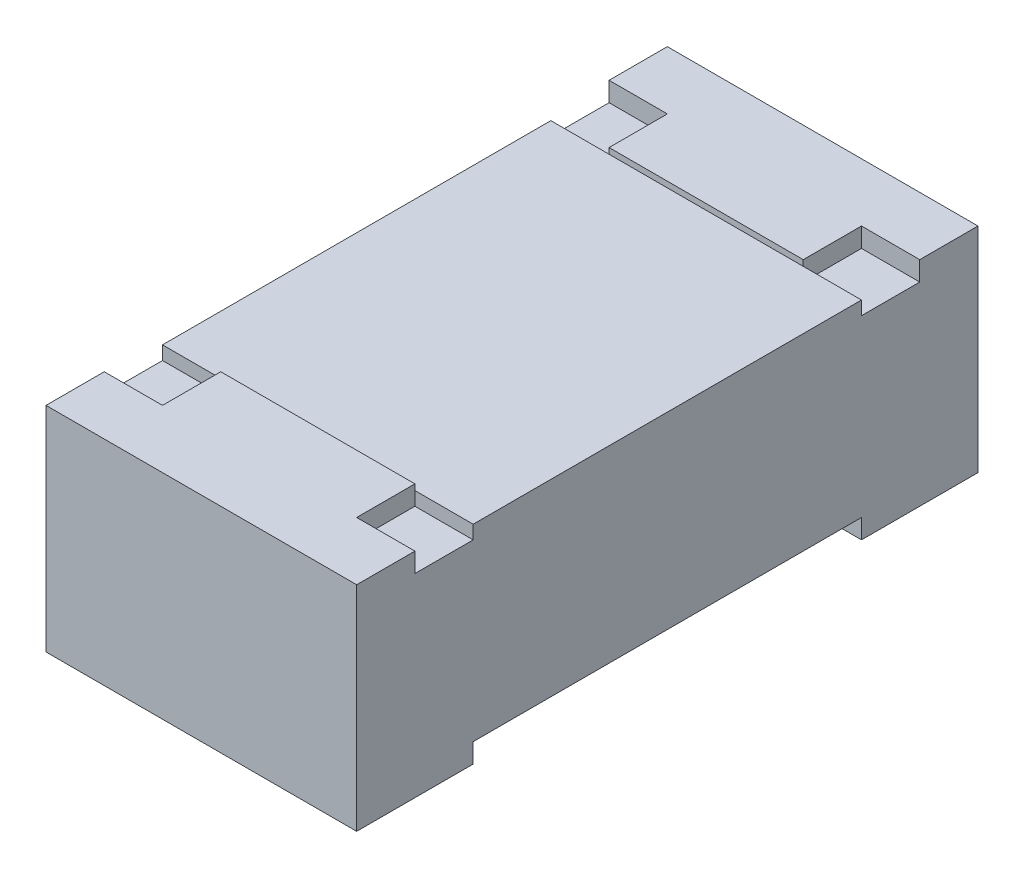
ISO-10303-21;
HEADER;
FILE_DESCRIPTION(('STEP AP214'),'2;1');
FILE_NAME('part.step','',(''),(''),'','','');
FILE_SCHEMA(('AUTOMOTIVE_DESIGN { 1 0 10303 214 1 1 1 1 }'));
ENDSEC;
DATA;
#1=APPLICATION_CONTEXT('core data for automotive mechanical design processes');
#2=APPLICATION_PROTOCOL_DEFINITION('international standard','automotive_design',2000,#1);
#3=PRODUCT_CONTEXT('',#1,'mechanical');
#4=PRODUCT('Part','Part','',(#3));
#5=PRODUCT_RELATED_PRODUCT_CATEGORY('part','',(#4));
#6=PRODUCT_DEFINITION_FORMATION('','',#4);
#7=PRODUCT_DEFINITION_CONTEXT('part definition',#1,'design');
#8=PRODUCT_DEFINITION('design','',#6,#7);
#9=PRODUCT_DEFINITION_SHAPE('','',#8);
#10=(LENGTH_UNIT() NAMED_UNIT(*) SI_UNIT(.MILLI.,.METRE.));
#11=(NAMED_UNIT(*) PLANE_ANGLE_UNIT() SI_UNIT($,.RADIAN.));
#12=(NAMED_UNIT(*) SI_UNIT($,.STERADIAN.) SOLID_ANGLE_UNIT());
#13=UNCERTAINTY_MEASURE_WITH_UNIT(LENGTH_MEASURE(1.E-05),#10,'distance_accuracy_value','');
#14=(GEOMETRIC_REPRESENTATION_CONTEXT(3) GLOBAL_UNCERTAINTY_ASSIGNED_CONTEXT((#13)) GLOBAL_UNIT_ASSIGNED_CONTEXT((#10,
#11,#12)) REPRESENTATION_CONTEXT('',''));
#15=CARTESIAN_POINT('',(0.,0.,0.));
#16=DIRECTION('',(0.,0.,1.));
#17=DIRECTION('',(1.,0.,0.));
#18=AXIS2_PLACEMENT_3D('',#15,#16,#17);
#19=CARTESIAN_POINT('',(-8.4899990165151,1.58166,-11.2730007134848));
#20=DIRECTION('',(0.,-1.,0.));
#21=DIRECTION('',(0.,0.,-1.));
#22=AXIS2_PLACEMENT_3D('',#19,#20,#21);
#23=PLANE('',#22);
#24=DIRECTION('',(-1.,0.,0.));
#25=VECTOR('',#24,1.);
#26=CARTESIAN_POINT('',(-8.4899990165151,1.58166,-11.5730007134848));
#27=LINE('',#26,#25);
#28=CARTESIAN_POINT('',(-8.4899990165151,1.58166,-11.5730007134848));
#29=VERTEX_POINT('',#28);
#30=CARTESIAN_POINT('',(-9.2899990165151,1.58166,-11.5730007134848));
#31=VERTEX_POINT('',#30);
#32=EDGE_CURVE('E19',#29,#31,#27,.T.);
#33=ORIENTED_EDGE('',*,*,#32,.F.);
#34=DIRECTION('',(0.,0.,-1.));
#35=VECTOR('',#34,1.);
#36=CARTESIAN_POINT('',(-8.4899990165151,1.58166,-11.5730007134848));
#37=LINE('',#36,#35);
#38=CARTESIAN_POINT('',(-8.4899990165151,1.58166,-11.2730007134848));
#39=VERTEX_POINT('',#38);
#40=EDGE_CURVE('E295',#39,#29,#37,.T.);
#41=ORIENTED_EDGE('',*,*,#40,.F.);
#42=DIRECTION('',(1.,0.,0.));
#43=VECTOR('',#42,1.);
#44=CARTESIAN_POINT('',(-8.4899990165151,1.58166,-11.2730007134848));
#45=LINE('',#44,#43);
#46=CARTESIAN_POINT('',(-9.2899990165151,1.58166,-11.2730007134848));
#47=VERTEX_POINT('',#46);
#48=EDGE_CURVE('E305',#47,#39,#45,.T.);
#49=ORIENTED_EDGE('',*,*,#48,.F.);
#50=DIRECTION('',(0.,0.,-1.));
#51=VECTOR('',#50,1.);
#52=CARTESIAN_POINT('',(-9.2899990165151,1.58166,-11.5730007134848));
#53=LINE('',#52,#51);
#54=EDGE_CURVE('E231',#47,#31,#53,.T.);
#55=ORIENTED_EDGE('',*,*,#54,.T.);
#56=EDGE_LOOP('',(#33,#41,#49,#55));
#57=FACE_BOUND('',#56,.T.);
#58=ADVANCED_FACE('F16',(#57),#23,.T.);
#59=CARTESIAN_POINT('',(-8.4899990165151,1.58166,-11.5730007134848));
#60=DIRECTION('',(0.,0.,-1.));
#61=DIRECTION('',(-1.,0.,0.));
#62=AXIS2_PLACEMENT_3D('',#59,#60,#61);
#63=PLANE('',#62);
#64=DIRECTION('',(1.,0.,0.));
#65=VECTOR('',#64,1.);
#66=CARTESIAN_POINT('',(-8.4899990165151,1.63166,-11.5730007134848));
#67=LINE('',#66,#65);
#68=CARTESIAN_POINT('',(-8.4899990165151,1.63166,-11.5730007134848));
#69=VERTEX_POINT('',#68);
#70=CARTESIAN_POINT('',(-9.2899990165151,1.63166,-11.5730007134848));
#71=VERTEX_POINT('',#70);
#72=EDGE_CURVE('E247',#69,#71,#67,.F.);
#73=ORIENTED_EDGE('',*,*,#72,.F.);
#74=DIRECTION('',(0.,1.,0.));
#75=VECTOR('',#74,1.);
#76=CARTESIAN_POINT('',(-8.4899990165151,1.58166,-11.5730007134848));
#77=LINE('',#76,#75);
#78=EDGE_CURVE('E226',#29,#69,#77,.T.);
#79=ORIENTED_EDGE('',*,*,#78,.F.);
#80=ORIENTED_EDGE('',*,*,#32,.T.);
#81=DIRECTION('',(0.,1.,0.));
#82=VECTOR('',#81,1.);
#83=CARTESIAN_POINT('',(-9.2899990165151,1.58166,-11.5730007134848));
#84=LINE('',#83,#82);
#85=EDGE_CURVE('E223',#31,#71,#84,.T.);
#86=ORIENTED_EDGE('',*,*,#85,.T.);
#87=EDGE_LOOP('',(#73,#79,#80,#86));
#88=FACE_BOUND('',#87,.T.);
#89=ADVANCED_FACE('F222',(#88),#63,.T.);
#90=CARTESIAN_POINT('',(-8.4899990165151,1.58166,-12.8730007134848));
#91=DIRECTION('',(0.,-1.,0.));
#92=DIRECTION('',(0.,0.,-1.));
#93=AXIS2_PLACEMENT_3D('',#90,#91,#92);
#94=PLANE('',#93);
#95=DIRECTION('',(-1.,0.,0.));
#96=VECTOR('',#95,1.);
#97=CARTESIAN_POINT('',(-8.4899990165151,1.58166,-12.8730007134848));
#98=LINE('',#97,#96);
#99=CARTESIAN_POINT('',(-8.4899990165151,1.58166,-12.8730007134848));
#100=VERTEX_POINT('',#99);
#101=CARTESIAN_POINT('',(-9.2899990165151,1.58166,-12.8730007134848));
#102=VERTEX_POINT('',#101);
#103=EDGE_CURVE('E192',#100,#102,#98,.T.);
#104=ORIENTED_EDGE('',*,*,#103,.F.);
#105=DIRECTION('',(0.,0.,1.));
#106=VECTOR('',#105,1.);
#107=CARTESIAN_POINT('',(-8.4899990165151,1.58166,-12.5730007134848));
#108=LINE('',#107,#106);
#109=CARTESIAN_POINT('',(-8.4899990165151,1.58166,-12.5730007134848));
#110=VERTEX_POINT('',#109);
#111=EDGE_CURVE('E291',#100,#110,#108,.T.);
#112=ORIENTED_EDGE('',*,*,#111,.T.);
#113=DIRECTION('',(1.,0.,0.));
#114=VECTOR('',#113,1.);
#115=CARTESIAN_POINT('',(-8.4899990165151,1.58166,-12.5730007134848));
#116=LINE('',#115,#114);
#117=CARTESIAN_POINT('',(-9.2899990165151,1.58166,-12.5730007134848));
#118=VERTEX_POINT('',#117);
#119=EDGE_CURVE('E187',#118,#110,#116,.T.);
#120=ORIENTED_EDGE('',*,*,#119,.F.);
#121=DIRECTION('',(0.,0.,1.));
#122=VECTOR('',#121,1.);
#123=CARTESIAN_POINT('',(-9.2899990165151,1.58166,-12.5730007134848));
#124=LINE('',#123,#122);
#125=EDGE_CURVE('E203',#102,#118,#124,.T.);
#126=ORIENTED_EDGE('',*,*,#125,.F.);
#127=EDGE_LOOP('',(#104,#112,#120,#126));
#128=FACE_BOUND('',#127,.T.);
#129=ADVANCED_FACE('F204',(#128),#94,.T.);
#130=CARTESIAN_POINT('',(-8.4899990165151,1.58166,-12.5730007134848));
#131=DIRECTION('',(0.,0.,1.));
#132=DIRECTION('',(1.,0.,0.));
#133=AXIS2_PLACEMENT_3D('',#130,#131,#132);
#134=PLANE('',#133);
#135=ORIENTED_EDGE('',*,*,#119,.T.);
#136=DIRECTION('',(0.,1.,0.));
#137=VECTOR('',#136,1.);
#138=CARTESIAN_POINT('',(-8.4899990165151,2.08166,-12.5730007134848));
#139=LINE('',#138,#137);
#140=CARTESIAN_POINT('',(-8.4899990165151,1.63166,-12.5730007134848));
#141=VERTEX_POINT('',#140);
#142=EDGE_CURVE('E289',#110,#141,#139,.T.);
#143=ORIENTED_EDGE('',*,*,#142,.T.);
#144=DIRECTION('',(1.,0.,0.));
#145=VECTOR('',#144,1.);
#146=CARTESIAN_POINT('',(-8.4899990165151,1.63166,-12.5730007134848));
#147=LINE('',#146,#145);
#148=CARTESIAN_POINT('',(-9.2899990165151,1.63166,-12.5730007134848));
#149=VERTEX_POINT('',#148);
#150=EDGE_CURVE('E245',#149,#141,#147,.T.);
#151=ORIENTED_EDGE('',*,*,#150,.F.);
#152=DIRECTION('',(0.,1.,0.));
#153=VECTOR('',#152,1.);
#154=CARTESIAN_POINT('',(-9.2899990165151,2.08166,-12.5730007134848));
#155=LINE('',#154,#153);
#156=EDGE_CURVE('E207',#118,#149,#155,.T.);
#157=ORIENTED_EDGE('',*,*,#156,.F.);
#158=EDGE_LOOP('',(#135,#143,#151,#157));
#159=FACE_BOUND('',#158,.T.);
#160=ADVANCED_FACE('F489',(#159),#134,.T.);
#161=CARTESIAN_POINT('',(-8.4899990165151,2.08166,-12.7230007134848));
#162=DIRECTION('',(0.,0.,-1.));
#163=DIRECTION('',(-1.,0.,0.));
#164=AXIS2_PLACEMENT_3D('',#161,#162,#163);
#165=PLANE('',#164);
#166=DIRECTION('',(0.,1.,0.));
#167=VECTOR('',#166,1.);
#168=CARTESIAN_POINT('',(-8.6399990165151,2.08166,-12.7230007134848));
#169=LINE('',#168,#167);
#170=CARTESIAN_POINT('',(-8.6399990165151,2.13166,-12.7230007134848));
#171=VERTEX_POINT('',#170);
#172=CARTESIAN_POINT('',(-8.6399990165151,2.08166,-12.7230007134848));
#173=VERTEX_POINT('',#172);
#174=EDGE_CURVE('E282',#171,#173,#169,.F.);
#175=ORIENTED_EDGE('',*,*,#174,.T.);
#176=DIRECTION('',(1.,0.,0.));
#177=VECTOR('',#176,1.);
#178=CARTESIAN_POINT('',(-8.4899990165151,2.08166,-12.7230007134848));
#179=LINE('',#178,#177);
#180=CARTESIAN_POINT('',(-8.4899990165151,2.08166,-12.7230007134848));
#181=VERTEX_POINT('',#180);
#182=EDGE_CURVE('E284',#181,#173,#179,.F.);
#183=ORIENTED_EDGE('',*,*,#182,.F.);
#184=DIRECTION('',(0.,1.,0.));
#185=VECTOR('',#184,1.);
#186=CARTESIAN_POINT('',(-8.4899990165151,2.08166,-12.7230007134848));
#187=LINE('',#186,#185);
#188=CARTESIAN_POINT('',(-8.4899990165151,2.13166,-12.7230007134848));
#189=VERTEX_POINT('',#188);
#190=EDGE_CURVE('E287',#181,#189,#187,.T.);
#191=ORIENTED_EDGE('',*,*,#190,.T.);
#192=DIRECTION('',(1.,0.,0.));
#193=VECTOR('',#192,1.);
#194=CARTESIAN_POINT('',(-8.4899990165151,2.13166,-12.7230007134848));
#195=LINE('',#194,#193);
#196=EDGE_CURVE('E274',#171,#189,#195,.T.);
#197=ORIENTED_EDGE('',*,*,#196,.F.);
#198=EDGE_LOOP('',(#175,#183,#191,#197));
#199=FACE_BOUND('',#198,.T.);
#200=ADVANCED_FACE('F491',(#199),#165,.F.);
#201=CARTESIAN_POINT('',(-8.4899990165151,2.13166,-12.8730007134848));
#202=DIRECTION('',(0.,0.,-1.));
#203=DIRECTION('',(-1.,0.,0.));
#204=AXIS2_PLACEMENT_3D('',#201,#202,#203);
#205=PLANE('',#204);
#206=DIRECTION('',(1.,0.,0.));
#207=VECTOR('',#206,1.);
#208=CARTESIAN_POINT('',(-8.4899990165151,2.13166,-12.8730007134848));
#209=LINE('',#208,#207);
#210=CARTESIAN_POINT('',(-8.4899990165151,2.13166,-12.8730007134848));
#211=VERTEX_POINT('',#210);
#212=CARTESIAN_POINT('',(-9.2899990165151,2.13166,-12.8730007134848));
#213=VERTEX_POINT('',#212);
#214=EDGE_CURVE('E269',#211,#213,#209,.F.);
#215=ORIENTED_EDGE('',*,*,#214,.F.);
#216=DIRECTION('',(0.,1.,0.));
#217=VECTOR('',#216,1.);
#218=CARTESIAN_POINT('',(-8.4899990165151,2.08166,-12.8730007134848));
#219=LINE('',#218,#217);
#220=EDGE_CURVE('E198',#211,#100,#219,.F.);
#221=ORIENTED_EDGE('',*,*,#220,.T.);
#222=ORIENTED_EDGE('',*,*,#103,.T.);
#223=DIRECTION('',(0.,1.,0.));
#224=VECTOR('',#223,1.);
#225=CARTESIAN_POINT('',(-9.2899990165151,2.08166,-12.8730007134848));
#226=LINE('',#225,#224);
#227=EDGE_CURVE('E196',#213,#102,#226,.F.);
#228=ORIENTED_EDGE('',*,*,#227,.F.);
#229=EDGE_LOOP('',(#215,#221,#222,#228));
#230=FACE_BOUND('',#229,.T.);
#231=ADVANCED_FACE('F194',(#230),#205,.T.);
#232=CARTESIAN_POINT('',(-9.2899990165151,2.08166,-12.7230007134848));
#233=DIRECTION('',(0.,0.,-1.));
#234=DIRECTION('',(-1.,0.,0.));
#235=AXIS2_PLACEMENT_3D('',#232,#233,#234);
#236=PLANE('',#235);
#237=DIRECTION('',(0.,1.,0.));
#238=VECTOR('',#237,1.);
#239=CARTESIAN_POINT('',(-9.2899990165151,2.08166,-12.7230007134848));
#240=LINE('',#239,#238);
#241=CARTESIAN_POINT('',(-9.2899990165151,2.08166,-12.7230007134848));
#242=VERTEX_POINT('',#241);
#243=CARTESIAN_POINT('',(-9.2899990165151,2.13166,-12.7230007134848));
#244=VERTEX_POINT('',#243);
#245=EDGE_CURVE('E200',#242,#244,#240,.T.);
#246=ORIENTED_EDGE('',*,*,#245,.F.);
#247=DIRECTION('',(1.,0.,0.));
#248=VECTOR('',#247,1.);
#249=CARTESIAN_POINT('',(-8.4899990165151,2.08166,-12.7230007134848));
#250=LINE('',#249,#248);
#251=CARTESIAN_POINT('',(-9.1399990165151,2.08166,-12.7230007134848));
#252=VERTEX_POINT('',#251);
#253=EDGE_CURVE('E249',#252,#242,#250,.F.);
#254=ORIENTED_EDGE('',*,*,#253,.F.);
#255=DIRECTION('',(0.,1.,0.));
#256=VECTOR('',#255,1.);
#257=CARTESIAN_POINT('',(-9.1399990165151,2.08166,-12.7230007134848));
#258=LINE('',#257,#256);
#259=CARTESIAN_POINT('',(-9.1399990165151,2.13166,-12.7230007134848));
#260=VERTEX_POINT('',#259);
#261=EDGE_CURVE('E263',#252,#260,#258,.T.);
#262=ORIENTED_EDGE('',*,*,#261,.T.);
#263=DIRECTION('',(1.,0.,0.));
#264=VECTOR('',#263,1.);
#265=CARTESIAN_POINT('',(-8.4899990165151,2.13166,-12.7230007134848));
#266=LINE('',#265,#264);
#267=EDGE_CURVE('E265',#244,#260,#266,.T.);
#268=ORIENTED_EDGE('',*,*,#267,.F.);
#269=EDGE_LOOP('',(#246,#254,#262,#268));
#270=FACE_BOUND('',#269,.T.);
#271=ADVANCED_FACE('F483',(#270),#236,.F.);
#272=CARTESIAN_POINT('',(-9.2899990165151,2.08166,-11.4230007134848));
#273=DIRECTION('',(0.,0.,1.));
#274=DIRECTION('',(1.,0.,0.));
#275=AXIS2_PLACEMENT_3D('',#272,#273,#274);
#276=PLANE('',#275);
#277=DIRECTION('',(0.,1.,0.));
#278=VECTOR('',#277,1.);
#279=CARTESIAN_POINT('',(-9.13999901651511,2.08166,-11.4230007134848));
#280=LINE('',#279,#278);
#281=CARTESIAN_POINT('',(-9.1399990165151,2.13166,-11.4230007134848));
#282=VERTEX_POINT('',#281);
#283=CARTESIAN_POINT('',(-9.1399990165151,2.08166,-11.4230007134848));
#284=VERTEX_POINT('',#283);
#285=EDGE_CURVE('E335',#282,#284,#280,.F.);
#286=ORIENTED_EDGE('',*,*,#285,.T.);
#287=DIRECTION('',(1.,0.,0.));
#288=VECTOR('',#287,1.);
#289=CARTESIAN_POINT('',(-8.4899990165151,2.08166,-11.4230007134848));
#290=LINE('',#289,#288);
#291=CARTESIAN_POINT('',(-9.2899990165151,2.08166,-11.4230007134848));
#292=VERTEX_POINT('',#291);
#293=EDGE_CURVE('E252',#292,#284,#290,.T.);
#294=ORIENTED_EDGE('',*,*,#293,.F.);
#295=DIRECTION('',(0.,1.,0.));
#296=VECTOR('',#295,1.);
#297=CARTESIAN_POINT('',(-9.2899990165151,1.58166,-11.4230007134848));
#298=LINE('',#297,#296);
#299=CARTESIAN_POINT('',(-9.2899990165151,2.13166,-11.4230007134848));
#300=VERTEX_POINT('',#299);
#301=EDGE_CURVE('E235',#292,#300,#298,.T.);
#302=ORIENTED_EDGE('',*,*,#301,.T.);
#303=DIRECTION('',(1.,0.,0.));
#304=VECTOR('',#303,1.);
#305=CARTESIAN_POINT('',(-8.4899990165151,2.13166,-11.4230007134848));
#306=LINE('',#305,#304);
#307=EDGE_CURVE('E318',#282,#300,#306,.F.);
#308=ORIENTED_EDGE('',*,*,#307,.F.);
#309=EDGE_LOOP('',(#286,#294,#302,#308));
#310=FACE_BOUND('',#309,.T.);
#311=ADVANCED_FACE('F553',(#310),#276,.F.);
#312=CARTESIAN_POINT('',(-8.4899990165151,2.13166,-11.2730007134848));
#313=DIRECTION('',(0.,0.,1.));
#314=DIRECTION('',(1.,0.,0.));
#315=AXIS2_PLACEMENT_3D('',#312,#313,#314);
#316=PLANE('',#315);
#317=ORIENTED_EDGE('',*,*,#48,.T.);
#318=DIRECTION('',(0.,1.,0.));
#319=VECTOR('',#318,1.);
#320=CARTESIAN_POINT('',(-8.4899990165151,1.58166,-11.2730007134848));
#321=LINE('',#320,#319);
#322=CARTESIAN_POINT('',(-8.4899990165151,2.13166,-11.2730007134848));
#323=VERTEX_POINT('',#322);
#324=EDGE_CURVE('E297',#323,#39,#321,.F.);
#325=ORIENTED_EDGE('',*,*,#324,.F.);
#326=DIRECTION('',(1.,0.,0.));
#327=VECTOR('',#326,1.);
#328=CARTESIAN_POINT('',(-8.4899990165151,2.13166,-11.2730007134848));
#329=LINE('',#328,#327);
#330=CARTESIAN_POINT('',(-9.2899990165151,2.13166,-11.2730007134848));
#331=VERTEX_POINT('',#330);
#332=EDGE_CURVE('E311',#331,#323,#329,.T.);
#333=ORIENTED_EDGE('',*,*,#332,.F.);
#334=DIRECTION('',(0.,1.,0.));
#335=VECTOR('',#334,1.);
#336=CARTESIAN_POINT('',(-9.2899990165151,2.13166,-11.2730007134848));
#337=LINE('',#336,#335);
#338=EDGE_CURVE('E237',#331,#47,#337,.F.);
#339=ORIENTED_EDGE('',*,*,#338,.T.);
#340=EDGE_LOOP('',(#317,#325,#333,#339));
#341=FACE_BOUND('',#340,.T.);
#342=ADVANCED_FACE('F309',(#341),#316,.T.);
#343=CARTESIAN_POINT('',(-8.4899990165151,2.08166,-11.4230007134848));
#344=DIRECTION('',(0.,0.,1.));
#345=DIRECTION('',(1.,0.,0.));
#346=AXIS2_PLACEMENT_3D('',#343,#344,#345);
#347=PLANE('',#346);
#348=DIRECTION('',(0.,1.,0.));
#349=VECTOR('',#348,1.);
#350=CARTESIAN_POINT('',(-8.4899990165151,1.58166,-11.4230007134848));
#351=LINE('',#350,#349);
#352=CARTESIAN_POINT('',(-8.4899990165151,2.08166,-11.4230007134848));
#353=VERTEX_POINT('',#352);
#354=CARTESIAN_POINT('',(-8.4899990165151,2.13166,-11.4230007134848));
#355=VERTEX_POINT('',#354);
#356=EDGE_CURVE('E300',#353,#355,#351,.T.);
#357=ORIENTED_EDGE('',*,*,#356,.F.);
#358=DIRECTION('',(1.,0.,0.));
#359=VECTOR('',#358,1.);
#360=CARTESIAN_POINT('',(-8.4899990165151,2.08166,-11.4230007134848));
#361=LINE('',#360,#359);
#362=CARTESIAN_POINT('',(-8.6399990165151,2.08166,-11.4230007134848));
#363=VERTEX_POINT('',#362);
#364=EDGE_CURVE('E400',#363,#353,#361,.T.);
#365=ORIENTED_EDGE('',*,*,#364,.F.);
#366=DIRECTION('',(0.,1.,0.));
#367=VECTOR('',#366,1.);
#368=CARTESIAN_POINT('',(-8.63999901651511,2.08166,-11.4230007134848));
#369=LINE('',#368,#367);
#370=CARTESIAN_POINT('',(-8.6399990165151,2.13166,-11.4230007134848));
#371=VERTEX_POINT('',#370);
#372=EDGE_CURVE('E405',#363,#371,#369,.T.);
#373=ORIENTED_EDGE('',*,*,#372,.T.);
#374=DIRECTION('',(1.,0.,0.));
#375=VECTOR('',#374,1.);
#376=CARTESIAN_POINT('',(-8.4899990165151,2.13166,-11.4230007134848));
#377=LINE('',#376,#375);
#378=EDGE_CURVE('E327',#355,#371,#377,.F.);
#379=ORIENTED_EDGE('',*,*,#378,.F.);
#380=EDGE_LOOP('',(#357,#365,#373,#379));
#381=FACE_BOUND('',#380,.T.);
#382=ADVANCED_FACE('F415',(#381),#347,.F.);
#383=CARTESIAN_POINT('',(-8.4899990165151,1.63166,-12.8230007134848));
#384=DIRECTION('',(0.,-1.,0.));
#385=DIRECTION('',(0.,0.,-1.));
#386=AXIS2_PLACEMENT_3D('',#383,#384,#385);
#387=PLANE('',#386);
#388=ORIENTED_EDGE('',*,*,#150,.T.);
#389=DIRECTION('',(0.,0.,1.));
#390=VECTOR('',#389,1.);
#391=CARTESIAN_POINT('',(-8.4899990165151,1.63166,-12.8230007134848));
#392=LINE('',#391,#390);
#393=EDGE_CURVE('E395',#141,#69,#392,.T.);
#394=ORIENTED_EDGE('',*,*,#393,.T.);
#395=ORIENTED_EDGE('',*,*,#72,.T.);
#396=DIRECTION('',(0.,0.,1.));
#397=VECTOR('',#396,1.);
#398=CARTESIAN_POINT('',(-9.2899990165151,1.63166,-12.8230007134848));
#399=LINE('',#398,#397);
#400=EDGE_CURVE('E234',#149,#71,#399,.T.);
#401=ORIENTED_EDGE('',*,*,#400,.F.);
#402=EDGE_LOOP('',(#388,#394,#395,#401));
#403=FACE_BOUND('',#402,.T.);
#404=ADVANCED_FACE('F243',(#403),#387,.T.);
#405=CARTESIAN_POINT('',(-8.4899990165151,2.08166,-12.8230007134848));
#406=DIRECTION('',(0.,1.,0.));
#407=DIRECTION('',(0.,0.,1.));
#408=AXIS2_PLACEMENT_3D('',#405,#406,#407);
#409=PLANE('',#408);
#410=DIRECTION('',(0.,0.,1.));
#411=VECTOR('',#410,1.);
#412=CARTESIAN_POINT('',(-8.4899990165151,2.08166,-12.8230007134848));
#413=LINE('',#412,#411);
#414=CARTESIAN_POINT('',(-8.4899990165151,2.08166,-12.5730007134848));
#415=VERTEX_POINT('',#414);
#416=EDGE_CURVE('E390',#415,#181,#413,.F.);
#417=ORIENTED_EDGE('',*,*,#416,.T.);
#418=ORIENTED_EDGE('',*,*,#182,.T.);
#419=DIRECTION('',(0.,0.,1.));
#420=VECTOR('',#419,1.);
#421=CARTESIAN_POINT('',(-8.6399990165151,2.08166,-12.7230007134848));
#422=LINE('',#421,#420);
#423=CARTESIAN_POINT('',(-8.6399990165151,2.08166,-12.5730007134848));
#424=VERTEX_POINT('',#423);
#425=EDGE_CURVE('E280',#173,#424,#422,.T.);
#426=ORIENTED_EDGE('',*,*,#425,.T.);
#427=DIRECTION('',(-1.,0.,0.));
#428=VECTOR('',#427,1.);
#429=CARTESIAN_POINT('',(-8.4899990165151,2.08166,-12.5730007134848));
#430=LINE('',#429,#428);
#431=EDGE_CURVE('E384',#415,#424,#430,.T.);
#432=ORIENTED_EDGE('',*,*,#431,.F.);
#433=EDGE_LOOP('',(#417,#418,#426,#432));
#434=FACE_BOUND('',#433,.T.);
#435=ADVANCED_FACE('F543',(#434),#409,.T.);
#436=CARTESIAN_POINT('',(-8.6399990165151,2.08166,-12.7230007134848));
#437=DIRECTION('',(-1.,0.,0.));
#438=DIRECTION('',(0.,0.,1.));
#439=AXIS2_PLACEMENT_3D('',#436,#437,#438);
#440=PLANE('',#439);
#441=DIRECTION('',(0.,1.,0.));
#442=VECTOR('',#441,1.);
#443=CARTESIAN_POINT('',(-8.6399990165151,2.11666,-12.5730007134848));
#444=LINE('',#443,#442);
#445=CARTESIAN_POINT('',(-8.6399990165151,2.11666,-12.5730007134848));
#446=VERTEX_POINT('',#445);
#447=EDGE_CURVE('E387',#424,#446,#444,.T.);
#448=ORIENTED_EDGE('',*,*,#447,.F.);
#449=ORIENTED_EDGE('',*,*,#425,.F.);
#450=ORIENTED_EDGE('',*,*,#174,.F.);
#451=DIRECTION('',(0.,0.,1.));
#452=VECTOR('',#451,1.);
#453=CARTESIAN_POINT('',(-8.6399990165151,2.13166,-12.5730007134848));
#454=LINE('',#453,#452);
#455=CARTESIAN_POINT('',(-8.6399990165151,2.13166,-12.5730007134848));
#456=VERTEX_POINT('',#455);
#457=EDGE_CURVE('E277',#456,#171,#454,.F.);
#458=ORIENTED_EDGE('',*,*,#457,.F.);
#459=DIRECTION('',(0.,1.,0.));
#460=VECTOR('',#459,1.);
#461=CARTESIAN_POINT('',(-8.6399990165151,2.13166,-12.5730007134848));
#462=LINE('',#461,#460);
#463=EDGE_CURVE('E381',#446,#456,#462,.T.);
#464=ORIENTED_EDGE('',*,*,#463,.F.);
#465=EDGE_LOOP('',(#448,#449,#450,#458,#464));
#466=FACE_BOUND('',#465,.T.);
#467=ADVANCED_FACE('F540',(#466),#440,.F.);
#468=CARTESIAN_POINT('',(-8.4899990165151,2.13166,-12.5730007134848));
#469=DIRECTION('',(0.,1.,0.));
#470=DIRECTION('',(0.,0.,1.));
#471=AXIS2_PLACEMENT_3D('',#468,#469,#470);
#472=PLANE('',#471);
#473=DIRECTION('',(0.,0.,-1.));
#474=VECTOR('',#473,1.);
#475=CARTESIAN_POINT('',(-9.1399990165151,2.13166,-12.7230007134848));
#476=LINE('',#475,#474);
#477=CARTESIAN_POINT('',(-9.1399990165151,2.13166,-12.5730007134848));
#478=VERTEX_POINT('',#477);
#479=EDGE_CURVE('E261',#260,#478,#476,.F.);
#480=ORIENTED_EDGE('',*,*,#479,.T.);
#481=DIRECTION('',(1.,0.,0.));
#482=VECTOR('',#481,1.);
#483=CARTESIAN_POINT('',(-8.4899990165151,2.13166,-12.5730007134848));
#484=LINE('',#483,#482);
#485=EDGE_CURVE('E378',#456,#478,#484,.F.);
#486=ORIENTED_EDGE('',*,*,#485,.F.);
#487=ORIENTED_EDGE('',*,*,#457,.T.);
#488=ORIENTED_EDGE('',*,*,#196,.T.);
#489=DIRECTION('',(0.,0.,1.));
#490=VECTOR('',#489,1.);
#491=CARTESIAN_POINT('',(-8.4899990165151,2.13166,-12.5730007134848));
#492=LINE('',#491,#490);
#493=EDGE_CURVE('E271',#189,#211,#492,.F.);
#494=ORIENTED_EDGE('',*,*,#493,.T.);
#495=ORIENTED_EDGE('',*,*,#214,.T.);
#496=DIRECTION('',(0.,0.,1.));
#497=VECTOR('',#496,1.);
#498=CARTESIAN_POINT('',(-9.2899990165151,2.13166,-12.5730007134848));
#499=LINE('',#498,#497);
#500=EDGE_CURVE('E211',#213,#244,#499,.T.);
#501=ORIENTED_EDGE('',*,*,#500,.T.);
#502=ORIENTED_EDGE('',*,*,#267,.T.);
#503=EDGE_LOOP('',(#480,#486,#487,#488,#494,#495,#501,#502));
#504=FACE_BOUND('',#503,.T.);
#505=ADVANCED_FACE('F486',(#504),#472,.T.);
#506=CARTESIAN_POINT('',(-9.1399990165151,2.08166,-12.7230007134848));
#507=DIRECTION('',(1.,0.,0.));
#508=DIRECTION('',(0.,0.,-1.));
#509=AXIS2_PLACEMENT_3D('',#506,#507,#508);
#510=PLANE('',#509);
#511=DIRECTION('',(0.,1.,0.));
#512=VECTOR('',#511,1.);
#513=CARTESIAN_POINT('',(-9.1399990165151,2.13166,-12.5730007134848));
#514=LINE('',#513,#512);
#515=CARTESIAN_POINT('',(-9.1399990165151,2.11666,-12.5730007134848));
#516=VERTEX_POINT('',#515);
#517=EDGE_CURVE('E375',#478,#516,#514,.F.);
#518=ORIENTED_EDGE('',*,*,#517,.F.);
#519=ORIENTED_EDGE('',*,*,#479,.F.);
#520=ORIENTED_EDGE('',*,*,#261,.F.);
#521=DIRECTION('',(0.,0.,1.));
#522=VECTOR('',#521,1.);
#523=CARTESIAN_POINT('',(-9.1399990165151,2.08166,-12.8230007134848));
#524=LINE('',#523,#522);
#525=CARTESIAN_POINT('',(-9.1399990165151,2.08166,-12.5730007134848));
#526=VERTEX_POINT('',#525);
#527=EDGE_CURVE('E255',#526,#252,#524,.F.);
#528=ORIENTED_EDGE('',*,*,#527,.F.);
#529=DIRECTION('',(0.,1.,0.));
#530=VECTOR('',#529,1.);
#531=CARTESIAN_POINT('',(-9.1399990165151,2.11666,-12.5730007134848));
#532=LINE('',#531,#530);
#533=EDGE_CURVE('E372',#516,#526,#532,.F.);
#534=ORIENTED_EDGE('',*,*,#533,.F.);
#535=EDGE_LOOP('',(#518,#519,#520,#528,#534));
#536=FACE_BOUND('',#535,.T.);
#537=ADVANCED_FACE('F534',(#536),#510,.F.);
#538=CARTESIAN_POINT('',(-8.4899990165151,2.08166,-12.8230007134848));
#539=DIRECTION('',(0.,1.,0.));
#540=DIRECTION('',(0.,0.,1.));
#541=AXIS2_PLACEMENT_3D('',#538,#539,#540);
#542=PLANE('',#541);
#543=DIRECTION('',(0.,0.,1.));
#544=VECTOR('',#543,1.);
#545=CARTESIAN_POINT('',(-9.2899990165151,2.08166,-12.8230007134848));
#546=LINE('',#545,#544);
#547=CARTESIAN_POINT('',(-9.2899990165151,2.08166,-12.5730007134848));
#548=VERTEX_POINT('',#547);
#549=EDGE_CURVE('E248',#548,#242,#546,.F.);
#550=ORIENTED_EDGE('',*,*,#549,.F.);
#551=DIRECTION('',(-1.,0.,0.));
#552=VECTOR('',#551,1.);
#553=CARTESIAN_POINT('',(-8.4899990165151,2.08166,-12.5730007134848));
#554=LINE('',#553,#552);
#555=EDGE_CURVE('E369',#526,#548,#554,.T.);
#556=ORIENTED_EDGE('',*,*,#555,.F.);
#557=ORIENTED_EDGE('',*,*,#527,.T.);
#558=ORIENTED_EDGE('',*,*,#253,.T.);
#559=EDGE_LOOP('',(#550,#556,#557,#558));
#560=FACE_BOUND('',#559,.T.);
#561=ADVANCED_FACE('F480',(#560),#542,.T.);
#562=CARTESIAN_POINT('',(-8.4899990165151,2.08166,-12.8230007134848));
#563=DIRECTION('',(0.,1.,0.));
#564=DIRECTION('',(0.,0.,1.));
#565=AXIS2_PLACEMENT_3D('',#562,#563,#564);
#566=PLANE('',#565);
#567=DIRECTION('',(1.,0.,0.));
#568=VECTOR('',#567,1.);
#569=CARTESIAN_POINT('',(-8.4899990165151,2.08166,-11.5730007134848));
#570=LINE('',#569,#568);
#571=CARTESIAN_POINT('',(-9.2899990165151,2.08166,-11.5730007134848));
#572=VERTEX_POINT('',#571);
#573=CARTESIAN_POINT('',(-9.1399990165151,2.08166,-11.5730007134848));
#574=VERTEX_POINT('',#573);
#575=EDGE_CURVE('E359',#572,#574,#570,.T.);
#576=ORIENTED_EDGE('',*,*,#575,.F.);
#577=DIRECTION('',(0.,0.,1.));
#578=VECTOR('',#577,1.);
#579=CARTESIAN_POINT('',(-9.2899990165151,2.08166,-12.8230007134848));
#580=LINE('',#579,#578);
#581=EDGE_CURVE('E337',#572,#292,#580,.T.);
#582=ORIENTED_EDGE('',*,*,#581,.T.);
#583=ORIENTED_EDGE('',*,*,#293,.T.);
#584=DIRECTION('',(0.,0.,-1.));
#585=VECTOR('',#584,1.);
#586=CARTESIAN_POINT('',(-9.1399990165151,2.08166,-12.7230007134848));
#587=LINE('',#586,#585);
#588=EDGE_CURVE('E333',#284,#574,#587,.T.);
#589=ORIENTED_EDGE('',*,*,#588,.T.);
#590=EDGE_LOOP('',(#576,#582,#583,#589));
#591=FACE_BOUND('',#590,.T.);
#592=ADVANCED_FACE('F343',(#591),#566,.T.);
#593=CARTESIAN_POINT('',(-9.1399990165151,2.08166,-12.7230007134848));
#594=DIRECTION('',(1.,0.,0.));
#595=DIRECTION('',(0.,0.,-1.));
#596=AXIS2_PLACEMENT_3D('',#593,#594,#595);
#597=PLANE('',#596);
#598=DIRECTION('',(0.,1.,0.));
#599=VECTOR('',#598,1.);
#600=CARTESIAN_POINT('',(-9.1399990165151,2.11666,-11.5730007134848));
#601=LINE('',#600,#599);
#602=CARTESIAN_POINT('',(-9.1399990165151,2.11666,-11.5730007134848));
#603=VERTEX_POINT('',#602);
#604=EDGE_CURVE('E348',#574,#603,#601,.T.);
#605=ORIENTED_EDGE('',*,*,#604,.F.);
#606=ORIENTED_EDGE('',*,*,#588,.F.);
#607=ORIENTED_EDGE('',*,*,#285,.F.);
#608=DIRECTION('',(0.,0.,1.));
#609=VECTOR('',#608,1.);
#610=CARTESIAN_POINT('',(-9.1399990165151,2.13166,-11.5730007134848));
#611=LINE('',#610,#609);
#612=CARTESIAN_POINT('',(-9.1399990165151,2.13166,-11.5730007134848));
#613=VERTEX_POINT('',#612);
#614=EDGE_CURVE('E324',#613,#282,#611,.T.);
#615=ORIENTED_EDGE('',*,*,#614,.F.);
#616=DIRECTION('',(0.,1.,0.));
#617=VECTOR('',#616,1.);
#618=CARTESIAN_POINT('',(-9.1399990165151,2.13166,-11.5730007134848));
#619=LINE('',#618,#617);
#620=EDGE_CURVE('E351',#603,#613,#619,.T.);
#621=ORIENTED_EDGE('',*,*,#620,.F.);
#622=EDGE_LOOP('',(#605,#606,#607,#615,#621));
#623=FACE_BOUND('',#622,.T.);
#624=ADVANCED_FACE('F346',(#623),#597,.F.);
#625=CARTESIAN_POINT('',(-8.4899990165151,2.13166,-11.5730007134848));
#626=DIRECTION('',(0.,1.,0.));
#627=DIRECTION('',(0.,0.,1.));
#628=AXIS2_PLACEMENT_3D('',#625,#626,#627);
#629=PLANE('',#628);
#630=ORIENTED_EDGE('',*,*,#332,.T.);
#631=DIRECTION('',(0.,0.,1.));
#632=VECTOR('',#631,1.);
#633=CARTESIAN_POINT('',(-8.4899990165151,2.13166,-11.5730007134848));
#634=LINE('',#633,#632);
#635=EDGE_CURVE('E407',#323,#355,#634,.F.);
#636=ORIENTED_EDGE('',*,*,#635,.T.);
#637=ORIENTED_EDGE('',*,*,#378,.T.);
#638=DIRECTION('',(0.,0.,1.));
#639=VECTOR('',#638,1.);
#640=CARTESIAN_POINT('',(-8.6399990165151,2.13166,-12.7230007134848));
#641=LINE('',#640,#639);
#642=CARTESIAN_POINT('',(-8.6399990165151,2.13166,-11.5730007134848));
#643=VERTEX_POINT('',#642);
#644=EDGE_CURVE('E403',#371,#643,#641,.F.);
#645=ORIENTED_EDGE('',*,*,#644,.T.);
#646=DIRECTION('',(-1.,0.,0.));
#647=VECTOR('',#646,1.);
#648=CARTESIAN_POINT('',(-8.4899990165151,2.13166,-11.5730007134848));
#649=LINE('',#648,#647);
#650=EDGE_CURVE('E362',#613,#643,#649,.F.);
#651=ORIENTED_EDGE('',*,*,#650,.F.);
#652=ORIENTED_EDGE('',*,*,#614,.T.);
#653=ORIENTED_EDGE('',*,*,#307,.T.);
#654=DIRECTION('',(0.,0.,1.));
#655=VECTOR('',#654,1.);
#656=CARTESIAN_POINT('',(-9.2899990165151,2.13166,-11.5730007134848));
#657=LINE('',#656,#655);
#658=EDGE_CURVE('E314',#300,#331,#657,.T.);
#659=ORIENTED_EDGE('',*,*,#658,.T.);
#660=EDGE_LOOP('',(#630,#636,#637,#645,#651,#652,#653,#659));
#661=FACE_BOUND('',#660,.T.);
#662=ADVANCED_FACE('F322',(#661),#629,.T.);
#663=CARTESIAN_POINT('',(-8.6399990165151,2.08166,-12.7230007134848));
#664=DIRECTION('',(-1.,0.,0.));
#665=DIRECTION('',(0.,0.,1.));
#666=AXIS2_PLACEMENT_3D('',#663,#664,#665);
#667=PLANE('',#666);
#668=DIRECTION('',(0.,1.,0.));
#669=VECTOR('',#668,1.);
#670=CARTESIAN_POINT('',(-8.6399990165151,2.13166,-11.5730007134848));
#671=LINE('',#670,#669);
#672=CARTESIAN_POINT('',(-8.6399990165151,2.11666,-11.5730007134848));
#673=VERTEX_POINT('',#672);
#674=EDGE_CURVE('E427',#643,#673,#671,.F.);
#675=ORIENTED_EDGE('',*,*,#674,.F.);
#676=ORIENTED_EDGE('',*,*,#644,.F.);
#677=ORIENTED_EDGE('',*,*,#372,.F.);
#678=DIRECTION('',(0.,0.,1.));
#679=VECTOR('',#678,1.);
#680=CARTESIAN_POINT('',(-8.6399990165151,2.08166,-12.8230007134848));
#681=LINE('',#680,#679);
#682=CARTESIAN_POINT('',(-8.6399990165151,2.08166,-11.5730007134848));
#683=VERTEX_POINT('',#682);
#684=EDGE_CURVE('E397',#683,#363,#681,.T.);
#685=ORIENTED_EDGE('',*,*,#684,.F.);
#686=DIRECTION('',(0.,1.,0.));
#687=VECTOR('',#686,1.);
#688=CARTESIAN_POINT('',(-8.6399990165151,2.11666,-11.5730007134848));
#689=LINE('',#688,#687);
#690=EDGE_CURVE('E425',#673,#683,#689,.F.);
#691=ORIENTED_EDGE('',*,*,#690,.F.);
#692=EDGE_LOOP('',(#675,#676,#677,#685,#691));
#693=FACE_BOUND('',#692,.T.);
#694=ADVANCED_FACE('F424',(#693),#667,.F.);
#695=CARTESIAN_POINT('',(-8.4899990165151,2.08166,-12.8230007134848));
#696=DIRECTION('',(0.,1.,0.));
#697=DIRECTION('',(0.,0.,1.));
#698=AXIS2_PLACEMENT_3D('',#695,#696,#697);
#699=PLANE('',#698);
#700=DIRECTION('',(1.,0.,0.));
#701=VECTOR('',#700,1.);
#702=CARTESIAN_POINT('',(-8.4899990165151,2.08166,-11.5730007134848));
#703=LINE('',#702,#701);
#704=CARTESIAN_POINT('',(-8.4899990165151,2.08166,-11.5730007134848));
#705=VERTEX_POINT('',#704);
#706=EDGE_CURVE('E420',#683,#705,#703,.T.);
#707=ORIENTED_EDGE('',*,*,#706,.F.);
#708=ORIENTED_EDGE('',*,*,#684,.T.);
#709=ORIENTED_EDGE('',*,*,#364,.T.);
#710=DIRECTION('',(0.,0.,1.));
#711=VECTOR('',#710,1.);
#712=CARTESIAN_POINT('',(-8.4899990165151,2.08166,-12.8230007134848));
#713=LINE('',#712,#711);
#714=EDGE_CURVE('E393',#353,#705,#713,.F.);
#715=ORIENTED_EDGE('',*,*,#714,.T.);
#716=EDGE_LOOP('',(#707,#708,#709,#715));
#717=FACE_BOUND('',#716,.T.);
#718=ADVANCED_FACE('F419',(#717),#699,.T.);
#719=CARTESIAN_POINT('',(-8.4899990165151,2.11666,-12.5730007134848));
#720=DIRECTION('',(0.,0.,-1.));
#721=DIRECTION('',(-1.,0.,0.));
#722=AXIS2_PLACEMENT_3D('',#719,#720,#721);
#723=PLANE('',#722);
#724=DIRECTION('',(0.,1.,0.));
#725=VECTOR('',#724,1.);
#726=CARTESIAN_POINT('',(-8.4899990165151,2.08166,-12.5730007134848));
#727=LINE('',#726,#725);
#728=CARTESIAN_POINT('',(-8.4899990165151,2.11666,-12.5730007134848));
#729=VERTEX_POINT('',#728);
#730=EDGE_CURVE('E455',#729,#415,#727,.F.);
#731=ORIENTED_EDGE('',*,*,#730,.T.);
#732=ORIENTED_EDGE('',*,*,#431,.T.);
#733=ORIENTED_EDGE('',*,*,#447,.T.);
#734=DIRECTION('',(1.,0.,0.));
#735=VECTOR('',#734,1.);
#736=CARTESIAN_POINT('',(-8.4899990165151,2.11666,-12.5730007134848));
#737=LINE('',#736,#735);
#738=EDGE_CURVE('E452',#729,#446,#737,.F.);
#739=ORIENTED_EDGE('',*,*,#738,.F.);
#740=EDGE_LOOP('',(#731,#732,#733,#739));
#741=FACE_BOUND('',#740,.T.);
#742=ADVANCED_FACE('F466',(#741),#723,.T.);
#743=CARTESIAN_POINT('',(-8.4899990165151,2.13166,-12.5730007134848));
#744=DIRECTION('',(0.,0.,1.));
#745=DIRECTION('',(1.,0.,0.));
#746=AXIS2_PLACEMENT_3D('',#743,#744,#745);
#747=PLANE('',#746);
#748=ORIENTED_EDGE('',*,*,#485,.T.);
#749=ORIENTED_EDGE('',*,*,#517,.T.);
#750=DIRECTION('',(1.,0.,0.));
#751=VECTOR('',#750,1.);
#752=CARTESIAN_POINT('',(-8.4899990165151,2.11666,-12.5730007134848));
#753=LINE('',#752,#751);
#754=EDGE_CURVE('E449',#446,#516,#753,.F.);
#755=ORIENTED_EDGE('',*,*,#754,.F.);
#756=ORIENTED_EDGE('',*,*,#463,.T.);
#757=EDGE_LOOP('',(#748,#749,#755,#756));
#758=FACE_BOUND('',#757,.T.);
#759=ADVANCED_FACE('F472',(#758),#747,.T.);
#760=CARTESIAN_POINT('',(-8.4899990165151,2.11666,-12.5730007134848));
#761=DIRECTION('',(0.,0.,-1.));
#762=DIRECTION('',(-1.,0.,0.));
#763=AXIS2_PLACEMENT_3D('',#760,#761,#762);
#764=PLANE('',#763);
#765=DIRECTION('',(0.,1.,0.));
#766=VECTOR('',#765,1.);
#767=CARTESIAN_POINT('',(-9.2899990165151,2.08166,-12.5730007134848));
#768=LINE('',#767,#766);
#769=CARTESIAN_POINT('',(-9.2899990165151,2.11666,-12.5730007134848));
#770=VERTEX_POINT('',#769);
#771=EDGE_CURVE('E356',#770,#548,#768,.F.);
#772=ORIENTED_EDGE('',*,*,#771,.F.);
#773=DIRECTION('',(1.,0.,0.));
#774=VECTOR('',#773,1.);
#775=CARTESIAN_POINT('',(-8.4899990165151,2.11666,-12.5730007134848));
#776=LINE('',#775,#774);
#777=EDGE_CURVE('E444',#516,#770,#776,.F.);
#778=ORIENTED_EDGE('',*,*,#777,.F.);
#779=ORIENTED_EDGE('',*,*,#533,.T.);
#780=ORIENTED_EDGE('',*,*,#555,.T.);
#781=EDGE_LOOP('',(#772,#778,#779,#780));
#782=FACE_BOUND('',#781,.T.);
#783=ADVANCED_FACE('F476',(#782),#764,.T.);
#784=CARTESIAN_POINT('',(-9.2899990165151,2.08166,-12.5730007134848));
#785=DIRECTION('',(-1.,0.,0.));
#786=DIRECTION('',(0.,0.,1.));
#787=AXIS2_PLACEMENT_3D('',#784,#785,#786);
#788=PLANE('',#787);
#789=ORIENTED_EDGE('',*,*,#156,.T.);
#790=ORIENTED_EDGE('',*,*,#400,.T.);
#791=ORIENTED_EDGE('',*,*,#85,.F.);
#792=ORIENTED_EDGE('',*,*,#54,.F.);
#793=ORIENTED_EDGE('',*,*,#338,.F.);
#794=ORIENTED_EDGE('',*,*,#658,.F.);
#795=ORIENTED_EDGE('',*,*,#301,.F.);
#796=ORIENTED_EDGE('',*,*,#581,.F.);
#797=DIRECTION('',(0.,1.,0.));
#798=VECTOR('',#797,1.);
#799=CARTESIAN_POINT('',(-9.2899990165151,2.11666,-11.5730007134848));
#800=LINE('',#799,#798);
#801=CARTESIAN_POINT('',(-9.2899990165151,2.11666,-11.5730007134848));
#802=VERTEX_POINT('',#801);
#803=EDGE_CURVE('E355',#802,#572,#800,.F.);
#804=ORIENTED_EDGE('',*,*,#803,.F.);
#805=DIRECTION('',(0.,0.,1.));
#806=VECTOR('',#805,1.);
#807=CARTESIAN_POINT('',(-9.2899990165151,2.11666,-12.5730007134848));
#808=LINE('',#807,#806);
#809=EDGE_CURVE('E442',#770,#802,#808,.T.);
#810=ORIENTED_EDGE('',*,*,#809,.F.);
#811=ORIENTED_EDGE('',*,*,#771,.T.);
#812=ORIENTED_EDGE('',*,*,#549,.T.);
#813=ORIENTED_EDGE('',*,*,#245,.T.);
#814=ORIENTED_EDGE('',*,*,#500,.F.);
#815=ORIENTED_EDGE('',*,*,#227,.T.);
#816=ORIENTED_EDGE('',*,*,#125,.T.);
#817=EDGE_LOOP('',(#789,#790,#791,#792,#793,#794,#795,#796,#804,#810,#811,#812,#813,#814,#815,#816));
#818=FACE_BOUND('',#817,.T.);
#819=ADVANCED_FACE('F209',(#818),#788,.T.);
#820=CARTESIAN_POINT('',(-8.4899990165151,2.11666,-11.5730007134848));
#821=DIRECTION('',(0.,0.,1.));
#822=DIRECTION('',(1.,0.,0.));
#823=AXIS2_PLACEMENT_3D('',#820,#821,#822);
#824=PLANE('',#823);
#825=ORIENTED_EDGE('',*,*,#803,.T.);
#826=ORIENTED_EDGE('',*,*,#575,.T.);
#827=ORIENTED_EDGE('',*,*,#604,.T.);
#828=DIRECTION('',(1.,0.,0.));
#829=VECTOR('',#828,1.);
#830=CARTESIAN_POINT('',(-8.4899990165151,2.11666,-11.5730007134848));
#831=LINE('',#830,#829);
#832=EDGE_CURVE('E436',#802,#603,#831,.T.);
#833=ORIENTED_EDGE('',*,*,#832,.F.);
#834=EDGE_LOOP('',(#825,#826,#827,#833));
#835=FACE_BOUND('',#834,.T.);
#836=ADVANCED_FACE('F360',(#835),#824,.T.);
#837=CARTESIAN_POINT('',(-8.4899990165151,2.13166,-11.5730007134848));
#838=DIRECTION('',(0.,0.,-1.));
#839=DIRECTION('',(-1.,0.,0.));
#840=AXIS2_PLACEMENT_3D('',#837,#838,#839);
#841=PLANE('',#840);
#842=ORIENTED_EDGE('',*,*,#650,.T.);
#843=ORIENTED_EDGE('',*,*,#674,.T.);
#844=DIRECTION('',(1.,0.,0.));
#845=VECTOR('',#844,1.);
#846=CARTESIAN_POINT('',(-8.4899990165151,2.11666,-11.5730007134848));
#847=LINE('',#846,#845);
#848=EDGE_CURVE('E432',#603,#673,#847,.T.);
#849=ORIENTED_EDGE('',*,*,#848,.F.);
#850=ORIENTED_EDGE('',*,*,#620,.T.);
#851=EDGE_LOOP('',(#842,#843,#849,#850));
#852=FACE_BOUND('',#851,.T.);
#853=ADVANCED_FACE('F430',(#852),#841,.T.);
#854=CARTESIAN_POINT('',(-8.4899990165151,2.11666,-11.5730007134848));
#855=DIRECTION('',(0.,0.,1.));
#856=DIRECTION('',(1.,0.,0.));
#857=AXIS2_PLACEMENT_3D('',#854,#855,#856);
#858=PLANE('',#857);
#859=DIRECTION('',(0.,1.,0.));
#860=VECTOR('',#859,1.);
#861=CARTESIAN_POINT('',(-8.4899990165151,2.08166,-11.5730007134848));
#862=LINE('',#861,#860);
#863=CARTESIAN_POINT('',(-8.4899990165151,2.11666,-11.5730007134848));
#864=VERTEX_POINT('',#863);
#865=EDGE_CURVE('E34',#705,#864,#862,.T.);
#866=ORIENTED_EDGE('',*,*,#865,.T.);
#867=DIRECTION('',(1.,0.,0.));
#868=VECTOR('',#867,1.);
#869=CARTESIAN_POINT('',(-8.4899990165151,2.11666,-11.5730007134848));
#870=LINE('',#869,#868);
#871=EDGE_CURVE('E25',#673,#864,#870,.T.);
#872=ORIENTED_EDGE('',*,*,#871,.F.);
#873=ORIENTED_EDGE('',*,*,#690,.T.);
#874=ORIENTED_EDGE('',*,*,#706,.T.);
#875=EDGE_LOOP('',(#866,#872,#873,#874));
#876=FACE_BOUND('',#875,.T.);
#877=ADVANCED_FACE('F461',(#876),#858,.T.);
#878=CARTESIAN_POINT('',(-8.4899990165151,2.08166,-12.5730007134848));
#879=DIRECTION('',(-1.,0.,0.));
#880=DIRECTION('',(0.,0.,1.));
#881=AXIS2_PLACEMENT_3D('',#878,#879,#880);
#882=PLANE('',#881);
#883=ORIENTED_EDGE('',*,*,#393,.F.);
#884=ORIENTED_EDGE('',*,*,#142,.F.);
#885=ORIENTED_EDGE('',*,*,#111,.F.);
#886=ORIENTED_EDGE('',*,*,#220,.F.);
#887=ORIENTED_EDGE('',*,*,#493,.F.);
#888=ORIENTED_EDGE('',*,*,#190,.F.);
#889=ORIENTED_EDGE('',*,*,#416,.F.);
#890=ORIENTED_EDGE('',*,*,#730,.F.);
#891=DIRECTION('',(0.,0.,1.));
#892=VECTOR('',#891,1.);
#893=CARTESIAN_POINT('',(-8.4899990165151,2.11666,-12.5730007134848));
#894=LINE('',#893,#892);
#895=EDGE_CURVE('E11',#864,#729,#894,.F.);
#896=ORIENTED_EDGE('',*,*,#895,.F.);
#897=ORIENTED_EDGE('',*,*,#865,.F.);
#898=ORIENTED_EDGE('',*,*,#714,.F.);
#899=ORIENTED_EDGE('',*,*,#356,.T.);
#900=ORIENTED_EDGE('',*,*,#635,.F.);
#901=ORIENTED_EDGE('',*,*,#324,.T.);
#902=ORIENTED_EDGE('',*,*,#40,.T.);
#903=ORIENTED_EDGE('',*,*,#78,.T.);
#904=EDGE_LOOP('',(#883,#884,#885,#886,#887,#888,#889,#890,#896,#897,#898,#899,#900,#901,#902,#903));
#905=FACE_BOUND('',#904,.T.);
#906=ADVANCED_FACE('F412',(#905),#882,.F.);
#907=CARTESIAN_POINT('',(-8.4899990165151,2.11666,-12.5730007134848));
#908=DIRECTION('',(0.,1.,0.));
#909=DIRECTION('',(0.,0.,1.));
#910=AXIS2_PLACEMENT_3D('',#907,#908,#909);
#911=PLANE('',#910);
#912=ORIENTED_EDGE('',*,*,#871,.T.);
#913=ORIENTED_EDGE('',*,*,#895,.T.);
#914=ORIENTED_EDGE('',*,*,#738,.T.);
#915=ORIENTED_EDGE('',*,*,#754,.T.);
#916=ORIENTED_EDGE('',*,*,#777,.T.);
#917=ORIENTED_EDGE('',*,*,#809,.T.);
#918=ORIENTED_EDGE('',*,*,#832,.T.);
#919=ORIENTED_EDGE('',*,*,#848,.T.);
#920=EDGE_LOOP('',(#912,#913,#914,#915,#916,#917,#918,#919));
#921=FACE_BOUND('',#920,.T.);
#922=ADVANCED_FACE('F439',(#921),#911,.T.);
#923=CLOSED_SHELL('',(#58,#89,#129,#160,#200,#231,#271,#311,#342,#382,#404,#435,#467,#505,#537,
#561,#592,#624,#662,#694,#718,#742,#759,#783,#819,#836,#853,#877,#906,#922));
#924=MANIFOLD_SOLID_BREP('B1',#923);
#925=ADVANCED_BREP_SHAPE_REPRESENTATION('',(#18,#924),#14);
#926=SHAPE_DEFINITION_REPRESENTATION(#9,#925);
ENDSEC;
END-ISO-10303-21;
